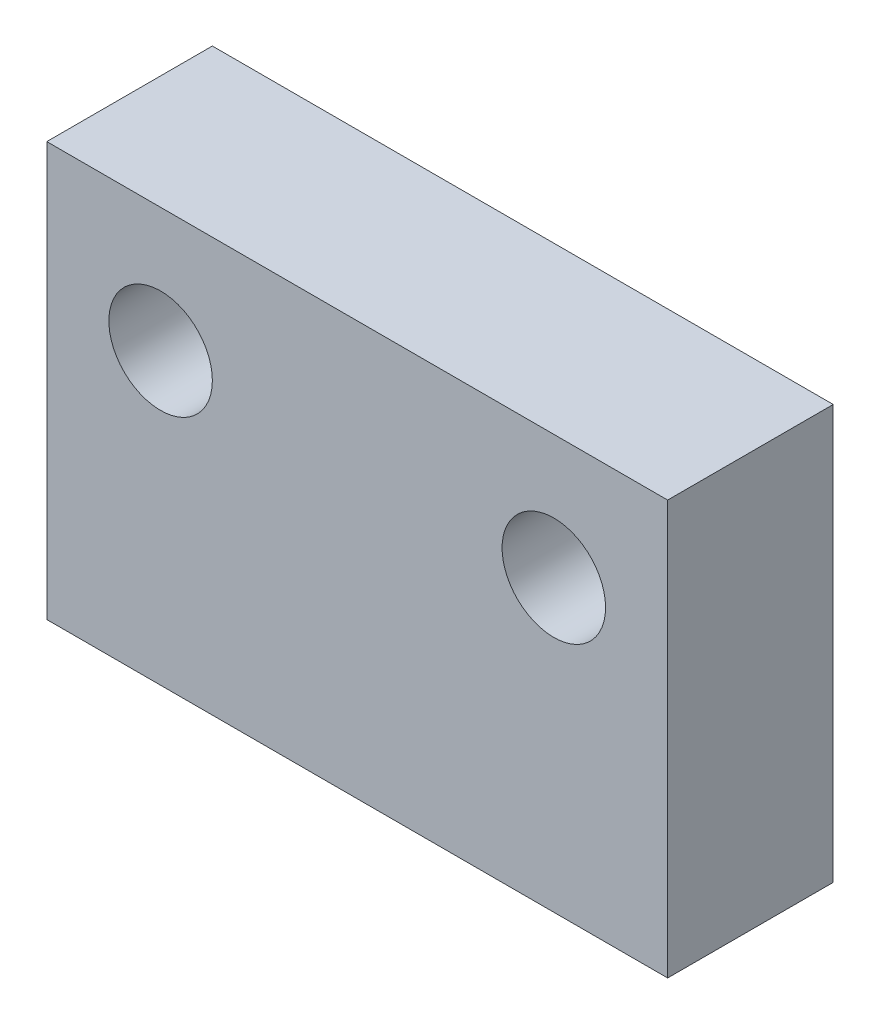
ISO-10303-21;
HEADER;
FILE_DESCRIPTION(('STEP AP214'),'2;1');
FILE_NAME('part.step','',(''),(''),'','','');
FILE_SCHEMA(('AUTOMOTIVE_DESIGN { 1 0 10303 214 1 1 1 1 }'));
ENDSEC;
DATA;
#1=APPLICATION_CONTEXT('core data for automotive mechanical design processes');
#2=APPLICATION_PROTOCOL_DEFINITION('international standard','automotive_design',2000,#1);
#3=PRODUCT_CONTEXT('',#1,'mechanical');
#4=PRODUCT('Part','Part','',(#3));
#5=PRODUCT_RELATED_PRODUCT_CATEGORY('part','',(#4));
#6=PRODUCT_DEFINITION_FORMATION('','',#4);
#7=PRODUCT_DEFINITION_CONTEXT('part definition',#1,'design');
#8=PRODUCT_DEFINITION('design','',#6,#7);
#9=PRODUCT_DEFINITION_SHAPE('','',#8);
#10=(LENGTH_UNIT() NAMED_UNIT(*) SI_UNIT(.MILLI.,.METRE.));
#11=(NAMED_UNIT(*) PLANE_ANGLE_UNIT() SI_UNIT($,.RADIAN.));
#12=(NAMED_UNIT(*) SI_UNIT($,.STERADIAN.) SOLID_ANGLE_UNIT());
#13=UNCERTAINTY_MEASURE_WITH_UNIT(LENGTH_MEASURE(1.E-05),#10,'distance_accuracy_value','');
#14=(GEOMETRIC_REPRESENTATION_CONTEXT(3) GLOBAL_UNCERTAINTY_ASSIGNED_CONTEXT((#13)) GLOBAL_UNIT_ASSIGNED_CONTEXT((#10,
#11,#12)) REPRESENTATION_CONTEXT('',''));
#15=CARTESIAN_POINT('',(0.,0.,0.));
#16=DIRECTION('',(0.,0.,1.));
#17=DIRECTION('',(1.,0.,0.));
#18=AXIS2_PLACEMENT_3D('',#15,#16,#17);
#19=CARTESIAN_POINT('',(0.,0.,4.));
#20=DIRECTION('',(0.,0.,-1.));
#21=DIRECTION('',(-1.,0.,0.));
#22=AXIS2_PLACEMENT_3D('',#19,#20,#21);
#23=PLANE('',#22);
#24=DIRECTION('',(0.,1.,0.));
#25=VECTOR('',#24,1.);
#26=CARTESIAN_POINT('',(7.5,-5.,4.));
#27=LINE('',#26,#25);
#28=CARTESIAN_POINT('',(7.5,-5.,4.));
#29=VERTEX_POINT('',#28);
#30=CARTESIAN_POINT('',(7.5,5.,4.));
#31=VERTEX_POINT('',#30);
#32=EDGE_CURVE('E89',#29,#31,#27,.T.);
#33=ORIENTED_EDGE('',*,*,#32,.T.);
#34=DIRECTION('',(-1.,0.,0.));
#35=VECTOR('',#34,1.);
#36=CARTESIAN_POINT('',(-7.5,5.,4.));
#37=LINE('',#36,#35);
#38=CARTESIAN_POINT('',(-7.5,5.,4.));
#39=VERTEX_POINT('',#38);
#40=EDGE_CURVE('E84',#31,#39,#37,.T.);
#41=ORIENTED_EDGE('',*,*,#40,.T.);
#42=DIRECTION('',(0.,-1.,0.));
#43=VECTOR('',#42,1.);
#44=CARTESIAN_POINT('',(-7.5,-5.,4.));
#45=LINE('',#44,#43);
#46=CARTESIAN_POINT('',(-7.5,-5.,4.));
#47=VERTEX_POINT('',#46);
#48=EDGE_CURVE('E87',#39,#47,#45,.T.);
#49=ORIENTED_EDGE('',*,*,#48,.T.);
#50=DIRECTION('',(1.,0.,0.));
#51=VECTOR('',#50,1.);
#52=CARTESIAN_POINT('',(-7.5,-5.,4.));
#53=LINE('',#52,#51);
#54=EDGE_CURVE('E54',#47,#29,#53,.T.);
#55=ORIENTED_EDGE('',*,*,#54,.T.);
#56=EDGE_LOOP('',(#33,#41,#49,#55));
#57=FACE_BOUND('',#56,.T.);
#58=CARTESIAN_POINT('',(-4.75,2.,4.));
#59=DIRECTION('',(0.,0.,1.));
#60=DIRECTION('',(1.,0.,0.));
#61=AXIS2_PLACEMENT_3D('',#58,#59,#60);
#62=CIRCLE('',#61,1.25);
#63=CARTESIAN_POINT('',(-3.5,2.,4.));
#64=VERTEX_POINT('',#63);
#65=EDGE_CURVE('E104',#64,#64,#62,.T.);
#66=ORIENTED_EDGE('',*,*,#65,.F.);
#67=EDGE_LOOP('',(#66));
#68=FACE_BOUND('',#67,.T.);
#69=CARTESIAN_POINT('',(4.75,2.,4.));
#70=DIRECTION('',(0.,0.,1.));
#71=DIRECTION('',(1.,0.,0.));
#72=AXIS2_PLACEMENT_3D('',#69,#70,#71);
#73=CIRCLE('',#72,1.25);
#74=CARTESIAN_POINT('',(6.,2.,4.));
#75=VERTEX_POINT('',#74);
#76=EDGE_CURVE('E119',#75,#75,#73,.T.);
#77=ORIENTED_EDGE('',*,*,#76,.F.);
#78=EDGE_LOOP('',(#77));
#79=FACE_BOUND('',#78,.T.);
#80=ADVANCED_FACE('F37',(#57,#68,#79),#23,.F.);
#81=CARTESIAN_POINT('',(0.,0.,0.));
#82=DIRECTION('',(0.,0.,-1.));
#83=DIRECTION('',(-1.,0.,0.));
#84=AXIS2_PLACEMENT_3D('',#81,#82,#83);
#85=PLANE('',#84);
#86=CARTESIAN_POINT('',(-4.75,2.,0.));
#87=DIRECTION('',(0.,0.,1.));
#88=DIRECTION('',(1.,0.,0.));
#89=AXIS2_PLACEMENT_3D('',#86,#87,#88);
#90=CIRCLE('',#89,1.25);
#91=CARTESIAN_POINT('',(-3.5,2.,0.));
#92=VERTEX_POINT('',#91);
#93=EDGE_CURVE('E116',#92,#92,#90,.T.);
#94=ORIENTED_EDGE('',*,*,#93,.T.);
#95=EDGE_LOOP('',(#94));
#96=FACE_BOUND('',#95,.T.);
#97=DIRECTION('',(0.,1.,0.));
#98=VECTOR('',#97,1.);
#99=CARTESIAN_POINT('',(7.5,-5.,0.));
#100=LINE('',#99,#98);
#101=CARTESIAN_POINT('',(7.5,-5.,0.));
#102=VERTEX_POINT('',#101);
#103=CARTESIAN_POINT('',(7.5,5.,0.));
#104=VERTEX_POINT('',#103);
#105=EDGE_CURVE('E101',#102,#104,#100,.T.);
#106=ORIENTED_EDGE('',*,*,#105,.F.);
#107=DIRECTION('',(1.,0.,0.));
#108=VECTOR('',#107,1.);
#109=CARTESIAN_POINT('',(-7.5,-5.,0.));
#110=LINE('',#109,#108);
#111=CARTESIAN_POINT('',(-7.5,-5.,0.));
#112=VERTEX_POINT('',#111);
#113=EDGE_CURVE('E77',#112,#102,#110,.T.);
#114=ORIENTED_EDGE('',*,*,#113,.F.);
#115=DIRECTION('',(0.,-1.,0.));
#116=VECTOR('',#115,1.);
#117=CARTESIAN_POINT('',(-7.5,-5.,0.));
#118=LINE('',#117,#116);
#119=CARTESIAN_POINT('',(-7.5,5.,0.));
#120=VERTEX_POINT('',#119);
#121=EDGE_CURVE('E71',#120,#112,#118,.T.);
#122=ORIENTED_EDGE('',*,*,#121,.F.);
#123=DIRECTION('',(-1.,0.,0.));
#124=VECTOR('',#123,1.);
#125=CARTESIAN_POINT('',(-7.5,5.,0.));
#126=LINE('',#125,#124);
#127=EDGE_CURVE('E93',#104,#120,#126,.T.);
#128=ORIENTED_EDGE('',*,*,#127,.F.);
#129=EDGE_LOOP('',(#106,#114,#122,#128));
#130=FACE_BOUND('',#129,.T.);
#131=CARTESIAN_POINT('',(4.75,2.,0.));
#132=DIRECTION('',(0.,0.,1.));
#133=DIRECTION('',(1.,0.,0.));
#134=AXIS2_PLACEMENT_3D('',#131,#132,#133);
#135=CIRCLE('',#134,1.25);
#136=CARTESIAN_POINT('',(6.,2.,0.));
#137=VERTEX_POINT('',#136);
#138=EDGE_CURVE('E122',#137,#137,#135,.T.);
#139=ORIENTED_EDGE('',*,*,#138,.T.);
#140=EDGE_LOOP('',(#139));
#141=FACE_BOUND('',#140,.T.);
#142=ADVANCED_FACE('F112',(#96,#130,#141),#85,.T.);
#143=CARTESIAN_POINT('',(7.5,-5.,4.));
#144=DIRECTION('',(-1.,0.,0.));
#145=DIRECTION('',(0.,0.,1.));
#146=AXIS2_PLACEMENT_3D('',#143,#144,#145);
#147=PLANE('',#146);
#148=ORIENTED_EDGE('',*,*,#105,.T.);
#149=DIRECTION('',(0.,0.,-1.));
#150=VECTOR('',#149,1.);
#151=CARTESIAN_POINT('',(7.5,5.,4.));
#152=LINE('',#151,#150);
#153=EDGE_CURVE('E11',#31,#104,#152,.T.);
#154=ORIENTED_EDGE('',*,*,#153,.F.);
#155=ORIENTED_EDGE('',*,*,#32,.F.);
#156=DIRECTION('',(0.,0.,-1.));
#157=VECTOR('',#156,1.);
#158=CARTESIAN_POINT('',(7.5,-5.,4.));
#159=LINE('',#158,#157);
#160=EDGE_CURVE('E97',#29,#102,#159,.T.);
#161=ORIENTED_EDGE('',*,*,#160,.T.);
#162=EDGE_LOOP('',(#148,#154,#155,#161));
#163=FACE_BOUND('',#162,.T.);
#164=ADVANCED_FACE('F39',(#163),#147,.F.);
#165=CARTESIAN_POINT('',(-7.5,5.,4.));
#166=DIRECTION('',(0.,-1.,0.));
#167=DIRECTION('',(1.,0.,0.));
#168=AXIS2_PLACEMENT_3D('',#165,#166,#167);
#169=PLANE('',#168);
#170=ORIENTED_EDGE('',*,*,#127,.T.);
#171=DIRECTION('',(0.,0.,-1.));
#172=VECTOR('',#171,1.);
#173=CARTESIAN_POINT('',(-7.5,5.,4.));
#174=LINE('',#173,#172);
#175=EDGE_CURVE('E46',#39,#120,#174,.T.);
#176=ORIENTED_EDGE('',*,*,#175,.F.);
#177=ORIENTED_EDGE('',*,*,#40,.F.);
#178=ORIENTED_EDGE('',*,*,#153,.T.);
#179=EDGE_LOOP('',(#170,#176,#177,#178));
#180=FACE_BOUND('',#179,.T.);
#181=ADVANCED_FACE('F92',(#180),#169,.F.);
#182=CARTESIAN_POINT('',(-7.5,-5.,4.));
#183=DIRECTION('',(1.,0.,0.));
#184=DIRECTION('',(0.,1.,0.));
#185=AXIS2_PLACEMENT_3D('',#182,#183,#184);
#186=PLANE('',#185);
#187=ORIENTED_EDGE('',*,*,#121,.T.);
#188=DIRECTION('',(0.,0.,-1.));
#189=VECTOR('',#188,1.);
#190=CARTESIAN_POINT('',(-7.5,-5.,4.));
#191=LINE('',#190,#189);
#192=EDGE_CURVE('E94',#47,#112,#191,.T.);
#193=ORIENTED_EDGE('',*,*,#192,.F.);
#194=ORIENTED_EDGE('',*,*,#48,.F.);
#195=ORIENTED_EDGE('',*,*,#175,.T.);
#196=EDGE_LOOP('',(#187,#193,#194,#195));
#197=FACE_BOUND('',#196,.T.);
#198=ADVANCED_FACE('F95',(#197),#186,.F.);
#199=CARTESIAN_POINT('',(-7.5,-5.,4.));
#200=DIRECTION('',(0.,1.,0.));
#201=DIRECTION('',(0.,0.,1.));
#202=AXIS2_PLACEMENT_3D('',#199,#200,#201);
#203=PLANE('',#202);
#204=ORIENTED_EDGE('',*,*,#113,.T.);
#205=ORIENTED_EDGE('',*,*,#160,.F.);
#206=ORIENTED_EDGE('',*,*,#54,.F.);
#207=ORIENTED_EDGE('',*,*,#192,.T.);
#208=EDGE_LOOP('',(#204,#205,#206,#207));
#209=FACE_BOUND('',#208,.T.);
#210=ADVANCED_FACE('F109',(#209),#203,.F.);
#211=CARTESIAN_POINT('',(-4.75,2.,4.));
#212=DIRECTION('',(0.,0.,-1.));
#213=DIRECTION('',(-1.,0.,0.));
#214=AXIS2_PLACEMENT_3D('',#211,#212,#213);
#215=CYLINDRICAL_SURFACE('',#214,1.25);
#216=ORIENTED_EDGE('',*,*,#65,.T.);
#217=EDGE_LOOP('',(#216));
#218=FACE_BOUND('',#217,.T.);
#219=ORIENTED_EDGE('',*,*,#93,.F.);
#220=EDGE_LOOP('',(#219));
#221=FACE_BOUND('',#220,.T.);
#222=ADVANCED_FACE('F139',(#218,#221),#215,.F.);
#223=CARTESIAN_POINT('',(4.75,2.,4.));
#224=DIRECTION('',(0.,0.,-1.));
#225=DIRECTION('',(-1.,0.,0.));
#226=AXIS2_PLACEMENT_3D('',#223,#224,#225);
#227=CYLINDRICAL_SURFACE('',#226,1.25);
#228=ORIENTED_EDGE('',*,*,#76,.T.);
#229=EDGE_LOOP('',(#228));
#230=FACE_BOUND('',#229,.T.);
#231=ORIENTED_EDGE('',*,*,#138,.F.);
#232=EDGE_LOOP('',(#231));
#233=FACE_BOUND('',#232,.T.);
#234=ADVANCED_FACE('F128',(#230,#233),#227,.F.);
#235=CLOSED_SHELL('',(#80,#142,#164,#181,#198,#210,#222,#234));
#236=MANIFOLD_SOLID_BREP('B2',#235);
#237=ADVANCED_BREP_SHAPE_REPRESENTATION('',(#18,#236),#14);
#238=SHAPE_DEFINITION_REPRESENTATION(#9,#237);
ENDSEC;
END-ISO-10303-21;
